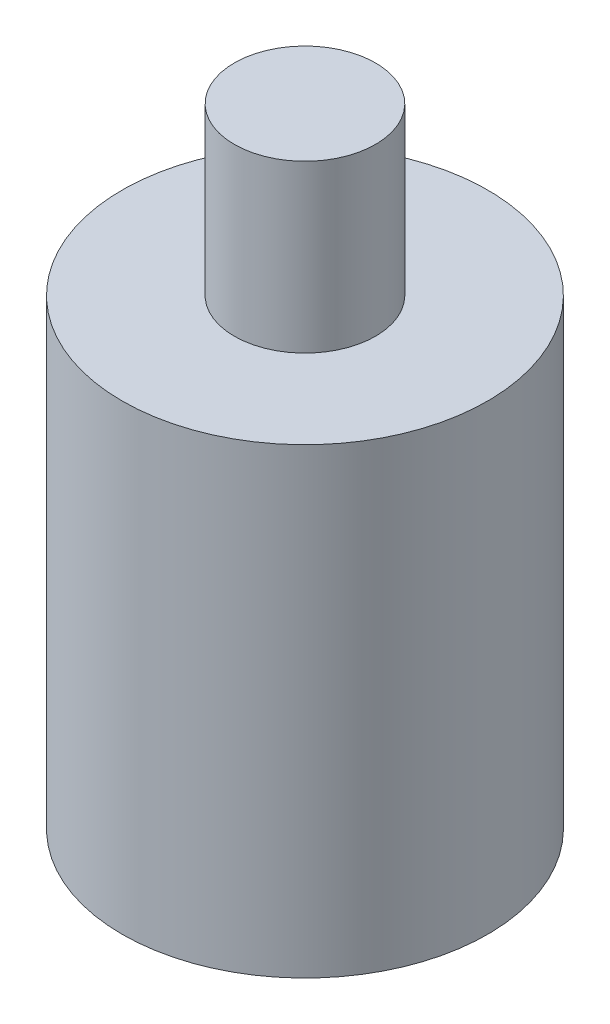
ISO-10303-21;
HEADER;
FILE_DESCRIPTION(('STEP AP214'),'2;1');
FILE_NAME('part.step','',(''),(''),'','','');
FILE_SCHEMA(('AUTOMOTIVE_DESIGN { 1 0 10303 214 1 1 1 1 }'));
ENDSEC;
DATA;
#1=APPLICATION_CONTEXT('core data for automotive mechanical design processes');
#2=APPLICATION_PROTOCOL_DEFINITION('international standard','automotive_design',2000,#1);
#3=PRODUCT_CONTEXT('',#1,'mechanical');
#4=PRODUCT('Part','Part','',(#3));
#5=PRODUCT_RELATED_PRODUCT_CATEGORY('part','',(#4));
#6=PRODUCT_DEFINITION_FORMATION('','',#4);
#7=PRODUCT_DEFINITION_CONTEXT('part definition',#1,'design');
#8=PRODUCT_DEFINITION('design','',#6,#7);
#9=PRODUCT_DEFINITION_SHAPE('','',#8);
#10=(LENGTH_UNIT() NAMED_UNIT(*) SI_UNIT(.MILLI.,.METRE.));
#11=(NAMED_UNIT(*) PLANE_ANGLE_UNIT() SI_UNIT($,.RADIAN.));
#12=(NAMED_UNIT(*) SI_UNIT($,.STERADIAN.) SOLID_ANGLE_UNIT());
#13=UNCERTAINTY_MEASURE_WITH_UNIT(LENGTH_MEASURE(1.E-05),#10,'distance_accuracy_value','');
#14=(GEOMETRIC_REPRESENTATION_CONTEXT(3) GLOBAL_UNCERTAINTY_ASSIGNED_CONTEXT((#13)) GLOBAL_UNIT_ASSIGNED_CONTEXT((#10,
#11,#12)) REPRESENTATION_CONTEXT('',''));
#15=CARTESIAN_POINT('',(0.,0.,0.));
#16=DIRECTION('',(0.,0.,1.));
#17=DIRECTION('',(1.,0.,0.));
#18=AXIS2_PLACEMENT_3D('',#15,#16,#17);
#19=CARTESIAN_POINT('',(0.,278.,0.));
#20=DIRECTION('',(0.,-1.,0.));
#21=DIRECTION('',(0.,0.,-1.));
#22=AXIS2_PLACEMENT_3D('',#19,#20,#21);
#23=CYLINDRICAL_SURFACE('',#22,110.);
#24=CARTESIAN_POINT('',(0.,278.,0.));
#25=DIRECTION('',(0.,1.,0.));
#26=DIRECTION('',(0.,0.,1.));
#27=AXIS2_PLACEMENT_3D('',#24,#25,#26);
#28=CIRCLE('',#27,110.);
#29=CARTESIAN_POINT('',(0.,278.,110.));
#30=VERTEX_POINT('',#29);
#31=EDGE_CURVE('E53',#30,#30,#28,.T.);
#32=ORIENTED_EDGE('',*,*,#31,.F.);
#33=EDGE_LOOP('',(#32));
#34=FACE_BOUND('',#33,.T.);
#35=CARTESIAN_POINT('',(0.,0.,0.));
#36=DIRECTION('',(0.,1.,0.));
#37=DIRECTION('',(0.,0.,1.));
#38=AXIS2_PLACEMENT_3D('',#35,#36,#37);
#39=CIRCLE('',#38,110.);
#40=CARTESIAN_POINT('',(0.,0.,110.));
#41=VERTEX_POINT('',#40);
#42=EDGE_CURVE('E48',#41,#41,#39,.T.);
#43=ORIENTED_EDGE('',*,*,#42,.T.);
#44=EDGE_LOOP('',(#43));
#45=FACE_BOUND('',#44,.T.);
#46=ADVANCED_FACE('F45',(#34,#45),#23,.T.);
#47=CARTESIAN_POINT('',(0.,278.,0.));
#48=DIRECTION('',(0.,1.,0.));
#49=DIRECTION('',(0.,0.,1.));
#50=AXIS2_PLACEMENT_3D('',#47,#48,#49);
#51=PLANE('',#50);
#52=CARTESIAN_POINT('',(0.,278.,0.));
#53=DIRECTION('',(0.,1.,0.));
#54=DIRECTION('',(0.,0.,1.));
#55=AXIS2_PLACEMENT_3D('',#52,#53,#54);
#56=CIRCLE('',#55,42.5);
#57=CARTESIAN_POINT('',(0.,278.,42.5));
#58=VERTEX_POINT('',#57);
#59=EDGE_CURVE('E10',#58,#58,#56,.T.);
#60=ORIENTED_EDGE('',*,*,#59,.F.);
#61=EDGE_LOOP('',(#60));
#62=FACE_BOUND('',#61,.T.);
#63=ORIENTED_EDGE('',*,*,#31,.T.);
#64=EDGE_LOOP('',(#63));
#65=FACE_BOUND('',#64,.T.);
#66=ADVANCED_FACE('F73',(#62,#65),#51,.T.);
#67=CARTESIAN_POINT('',(0.,0.,0.));
#68=DIRECTION('',(0.,1.,0.));
#69=DIRECTION('',(0.,0.,1.));
#70=AXIS2_PLACEMENT_3D('',#67,#68,#69);
#71=PLANE('',#70);
#72=ORIENTED_EDGE('',*,*,#42,.F.);
#73=EDGE_LOOP('',(#72));
#74=FACE_BOUND('',#73,.T.);
#75=ADVANCED_FACE('F70',(#74),#71,.F.);
#76=CARTESIAN_POINT('',(0.,378.,0.));
#77=DIRECTION('',(0.,-1.,0.));
#78=DIRECTION('',(0.,0.,-1.));
#79=AXIS2_PLACEMENT_3D('',#76,#77,#78);
#80=CYLINDRICAL_SURFACE('',#79,42.5);
#81=CARTESIAN_POINT('',(0.,378.,0.));
#82=DIRECTION('',(0.,1.,0.));
#83=DIRECTION('',(0.,0.,1.));
#84=AXIS2_PLACEMENT_3D('',#81,#82,#83);
#85=CIRCLE('',#84,42.5);
#86=CARTESIAN_POINT('',(0.,378.,42.5));
#87=VERTEX_POINT('',#86);
#88=EDGE_CURVE('E60',#87,#87,#85,.T.);
#89=ORIENTED_EDGE('',*,*,#88,.F.);
#90=EDGE_LOOP('',(#89));
#91=FACE_BOUND('',#90,.T.);
#92=ORIENTED_EDGE('',*,*,#59,.T.);
#93=EDGE_LOOP('',(#92));
#94=FACE_BOUND('',#93,.T.);
#95=ADVANCED_FACE('F72',(#91,#94),#80,.T.);
#96=CARTESIAN_POINT('',(0.,378.,0.));
#97=DIRECTION('',(0.,1.,0.));
#98=DIRECTION('',(0.,0.,1.));
#99=AXIS2_PLACEMENT_3D('',#96,#97,#98);
#100=PLANE('',#99);
#101=ORIENTED_EDGE('',*,*,#88,.T.);
#102=EDGE_LOOP('',(#101));
#103=FACE_BOUND('',#102,.T.);
#104=ADVANCED_FACE('F79',(#103),#100,.T.);
#105=CLOSED_SHELL('',(#46,#66,#75,#95,#104));
#106=MANIFOLD_SOLID_BREP('B2',#105);
#107=ADVANCED_BREP_SHAPE_REPRESENTATION('',(#18,#106),#14);
#108=SHAPE_DEFINITION_REPRESENTATION(#9,#107);
ENDSEC;
END-ISO-10303-21;
